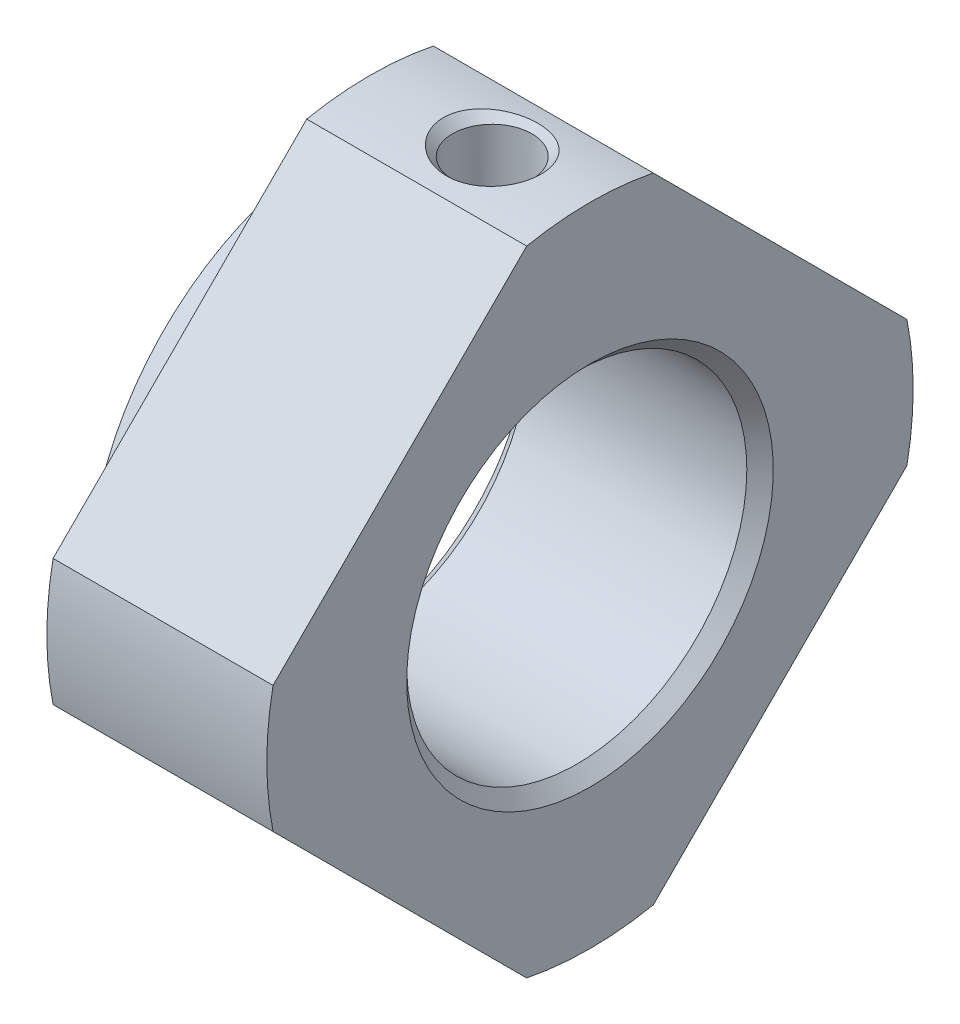
ISO-10303-21;
HEADER;
FILE_DESCRIPTION(('STEP AP214'),'2;1');
FILE_NAME('part.step','',(''),(''),'','','');
FILE_SCHEMA(('AUTOMOTIVE_DESIGN { 1 0 10303 214 1 1 1 1 }'));
ENDSEC;
DATA;
#1=APPLICATION_CONTEXT('core data for automotive mechanical design processes');
#2=APPLICATION_PROTOCOL_DEFINITION('international standard','automotive_design',2000,#1);
#3=PRODUCT_CONTEXT('',#1,'mechanical');
#4=PRODUCT('Part','Part','',(#3));
#5=PRODUCT_RELATED_PRODUCT_CATEGORY('part','',(#4));
#6=PRODUCT_DEFINITION_FORMATION('','',#4);
#7=PRODUCT_DEFINITION_CONTEXT('part definition',#1,'design');
#8=PRODUCT_DEFINITION('design','',#6,#7);
#9=PRODUCT_DEFINITION_SHAPE('','',#8);
#10=(LENGTH_UNIT() NAMED_UNIT(*) SI_UNIT(.MILLI.,.METRE.));
#11=(NAMED_UNIT(*) PLANE_ANGLE_UNIT() SI_UNIT($,.RADIAN.));
#12=(NAMED_UNIT(*) SI_UNIT($,.STERADIAN.) SOLID_ANGLE_UNIT());
#13=UNCERTAINTY_MEASURE_WITH_UNIT(LENGTH_MEASURE(1.E-05),#10,'distance_accuracy_value','');
#14=(GEOMETRIC_REPRESENTATION_CONTEXT(3) GLOBAL_UNCERTAINTY_ASSIGNED_CONTEXT((#13)) GLOBAL_UNIT_ASSIGNED_CONTEXT((#10,
#11,#12)) REPRESENTATION_CONTEXT('',''));
#15=CARTESIAN_POINT('',(0.,0.,0.));
#16=DIRECTION('',(0.,0.,1.));
#17=DIRECTION('',(1.,0.,0.));
#18=AXIS2_PLACEMENT_3D('',#15,#16,#17);
#19=CARTESIAN_POINT('',(33.,3.71231060122937,-3.71231060122938));
#20=DIRECTION('',(-1.,0.,0.));
#21=DIRECTION('',(0.,0.,1.));
#22=AXIS2_PLACEMENT_3D('',#19,#20,#21);
#23=PLANE('',#22);
#24=CARTESIAN_POINT('',(33.,0.,0.));
#25=DIRECTION('',(1.,0.,0.));
#26=DIRECTION('',(0.,0.,-1.));
#27=AXIS2_PLACEMENT_3D('',#24,#25,#26);
#28=CIRCLE('',#27,10.5);
#29=CARTESIAN_POINT('',(33.,0.,-10.5));
#30=VERTEX_POINT('',#29);
#31=EDGE_CURVE('E128',#30,#30,#28,.T.);
#32=ORIENTED_EDGE('',*,*,#31,.F.);
#33=EDGE_LOOP('',(#32));
#34=FACE_BOUND('',#33,.T.);
#35=CARTESIAN_POINT('',(33.,0.,0.));
#36=DIRECTION('',(-1.,0.,0.));
#37=DIRECTION('',(0.,0.,1.));
#38=AXIS2_PLACEMENT_3D('',#35,#36,#37);
#39=CIRCLE('',#38,7.5);
#40=CARTESIAN_POINT('',(33.,0.,7.5));
#41=VERTEX_POINT('',#40);
#42=EDGE_CURVE('E19',#41,#41,#39,.F.);
#43=ORIENTED_EDGE('',*,*,#42,.T.);
#44=EDGE_LOOP('',(#43));
#45=FACE_BOUND('',#44,.T.);
#46=ADVANCED_FACE('F16',(#34,#45),#23,.T.);
#47=CARTESIAN_POINT('',(33.,0.,0.));
#48=DIRECTION('',(-1.,0.,0.));
#49=DIRECTION('',(0.,0.,1.));
#50=AXIS2_PLACEMENT_3D('',#47,#48,#49);
#51=CONICAL_SURFACE('',#50,7.5,0.785398163397448);
#52=CARTESIAN_POINT('',(33.5415,0.,0.));
#53=DIRECTION('',(1.,0.,0.));
#54=DIRECTION('',(0.,0.,-1.));
#55=AXIS2_PLACEMENT_3D('',#52,#53,#54);
#56=CIRCLE('',#55,6.9585);
#57=CARTESIAN_POINT('',(33.5415,0.,-6.9585));
#58=VERTEX_POINT('',#57);
#59=EDGE_CURVE('E126',#58,#58,#56,.T.);
#60=ORIENTED_EDGE('',*,*,#59,.T.);
#61=EDGE_LOOP('',(#60));
#62=FACE_BOUND('',#61,.T.);
#63=ORIENTED_EDGE('',*,*,#42,.F.);
#64=EDGE_LOOP('',(#63));
#65=FACE_BOUND('',#64,.T.);
#66=ADVANCED_FACE('F218',(#62,#65),#51,.F.);
#67=CARTESIAN_POINT('',(39.,6.42194840409422,0.));
#68=DIRECTION('',(0.,-1.,0.));
#69=DIRECTION('',(0.,0.,-1.));
#70=AXIS2_PLACEMENT_3D('',#67,#68,#69);
#71=CYLINDRICAL_SURFACE('',#70,1.621);
#72=CARTESIAN_POINT('',(40.621,6.9585,0.));
#73=CARTESIAN_POINT('',(40.6209961033469,6.95849780594156,0.0897274262725483));
#74=CARTESIAN_POINT('',(40.6135227117356,6.95674642617646,0.179507354052342));
#75=CARTESIAN_POINT('',(40.5838559431143,6.9499266223995,0.356527871141645));
#76=CARTESIAN_POINT('',(40.561648005776,6.94485491738691,0.443765859461116));
#77=CARTESIAN_POINT('',(40.5032539210325,6.9319584347365,0.613088054593298));
#78=CARTESIAN_POINT('',(40.4670852275425,6.92413709581094,0.695178548489428));
#79=CARTESIAN_POINT('',(40.381850776793,6.9065809389101,0.852118334084797));
#80=CARTESIAN_POINT('',(40.3327859235892,6.89684625507751,0.926968132873286));
#81=CARTESIAN_POINT('',(40.2222121858088,6.8763283901825,1.06866478286299));
#82=CARTESIAN_POINT('',(40.1605142906382,6.8655307583926,1.13536206031686));
#83=CARTESIAN_POINT('',(40.026830489751,6.84420308998696,1.25756226192315));
#84=CARTESIAN_POINT('',(39.9548434404866,6.83367308326878,1.31306394012881));
#85=CARTESIAN_POINT('',(39.8014974646031,6.81392955346188,1.41197402254987));
#86=CARTESIAN_POINT('',(39.7200311847712,6.80473443574684,1.45521999563199));
#87=CARTESIAN_POINT('',(39.5507374254725,6.78891032458931,1.52734788122463));
#88=CARTESIAN_POINT('',(39.462910833463,6.78228097395995,1.55623179327318));
#89=CARTESIAN_POINT('',(39.285019027532,6.77248650598185,1.59831532900658));
#90=CARTESIAN_POINT('',(39.1950200921909,6.76926266966684,1.61178115006425));
#91=CARTESIAN_POINT('',(39.0139871226963,6.76646815850686,1.62347463345183));
#92=CARTESIAN_POINT('',(38.922953233911,6.76689697679374,1.62170441004248));
#93=CARTESIAN_POINT('',(38.7444404395851,6.77130632924541,1.60318946410242));
#94=CARTESIAN_POINT('',(38.6569269832336,6.77521268165786,1.58675748517433));
#95=CARTESIAN_POINT('',(38.4859336242832,6.78601930332385,1.53988225455685));
#96=CARTESIAN_POINT('',(38.4024540018105,6.79291978017075,1.50943803133952));
#97=CARTESIAN_POINT('',(38.2410349378862,6.80900826661425,1.43512346233004));
#98=CARTESIAN_POINT('',(38.163151734714,6.81821618664878,1.39113545232069));
#99=CARTESIAN_POINT('',(38.0157633684327,6.83786946067854,1.29106770903717));
#100=CARTESIAN_POINT('',(37.9462589125058,6.84831491897705,1.23498695622492));
#101=CARTESIAN_POINT('',(37.8158093354942,6.86958071935372,1.11069635122768));
#102=CARTESIAN_POINT('',(37.7551151097438,6.88040398222722,1.0422234131));
#103=CARTESIAN_POINT('',(37.6460017062912,6.90097906869489,0.895912339506155));
#104=CARTESIAN_POINT('',(37.5975878406771,6.91073042758797,0.818070172608211));
#105=CARTESIAN_POINT('',(37.514336242374,6.92810288468193,0.654879800905384));
#106=CARTESIAN_POINT('',(37.4795456523797,6.93571656026308,0.569506762699594));
#107=CARTESIAN_POINT('',(37.4249429776949,6.94788944458202,0.394014624097667));
#108=CARTESIAN_POINT('',(37.4050995961583,6.95245503318885,0.303905865348113));
#109=CARTESIAN_POINT('',(37.3883598020422,6.95632462931962,0.177562517043549));
#110=CARTESIAN_POINT('',(37.3848531264986,6.95713845201414,0.142150866952607));
#111=CARTESIAN_POINT('',(37.3801723317949,6.95822662711759,0.0711651298945416));
#112=CARTESIAN_POINT('',(37.3789982193353,6.95850097797686,0.0355910424611007));
#113=CARTESIAN_POINT('',(37.3790044854889,6.95849753647927,-0.089653727089235));
#114=CARTESIAN_POINT('',(37.3864704192277,6.95674801634259,-0.179415039688452));
#115=CARTESIAN_POINT('',(37.4161232412874,6.94993139801827,-0.356455077564178));
#116=CARTESIAN_POINT('',(37.4383383745779,6.94485793466903,-0.443728703787575));
#117=CARTESIAN_POINT('',(37.4967496607638,6.93195763435398,-0.613096107765031));
#118=CARTESIAN_POINT('',(37.5329235413601,6.9241351853814,-0.695197896067546));
#119=CARTESIAN_POINT('',(37.6181611758861,6.90657858086986,-0.852137138773338));
#120=CARTESIAN_POINT('',(37.6672209007002,6.89684502313169,-0.92697685386537));
#121=CARTESIAN_POINT('',(37.7777809267791,6.8763296332837,-1.06865598137256));
#122=CARTESIAN_POINT('',(37.8394701933452,6.86553335313026,-1.13534585655861));
#123=CARTESIAN_POINT('',(37.973152755563,6.8442056440334,-1.25754896710614));
#124=CARTESIAN_POINT('',(38.0451496689862,6.83367430961273,-1.3130582617808));
#125=CARTESIAN_POINT('',(38.1985399144183,6.81392439723727,-1.41199938251277));
#126=CARTESIAN_POINT('',(38.2800439179007,6.80472480966848,-1.45526358708207));
#127=CARTESIAN_POINT('',(38.4493622480002,6.78890361037873,-1.52737875573525));
#128=CARTESIAN_POINT('',(38.53716909795,6.78227900209067,-1.55624648449809));
#129=CARTESIAN_POINT('',(38.6878550936689,6.77397836438543,-1.59190108149123));
#130=CARTESIAN_POINT('',(38.7497437569557,6.77139770047164,-1.60279497058478));
#131=CARTESIAN_POINT('',(38.8744130367346,6.76793696289701,-1.61734569160545));
#132=CARTESIAN_POINT('',(38.9371936252452,6.76705683600506,-1.62100275006376));
#133=CARTESIAN_POINT('',(39.0896901983103,6.76706096731647,-1.62099607279095));
#134=CARTESIAN_POINT('',(39.1794329826773,6.76886171555005,-1.61352867405773));
#135=CARTESIAN_POINT('',(39.3563763131611,6.77585742352259,-1.58388784936477));
#136=CARTESIAN_POINT('',(39.4435742274314,6.78105577550452,-1.5616997255722));
#137=CARTESIAN_POINT('',(39.6128127220595,6.79422611425536,-1.50336318249269));
#138=CARTESIAN_POINT('',(39.6948598561299,6.80219448846792,-1.46723293925978));
#139=CARTESIAN_POINT('',(39.8517242395329,6.82000237430665,-1.38209007411957));
#140=CARTESIAN_POINT('',(39.9265421501401,6.82984171454621,-1.33307863201532));
#141=CARTESIAN_POINT('',(40.0682625353162,6.85049340752902,-1.22256621643576));
#142=CARTESIAN_POINT('',(40.1350071533064,6.86131955960115,-1.16086535850212));
#143=CARTESIAN_POINT('',(40.2573139005216,6.88260728170114,-1.02713920633628));
#144=CARTESIAN_POINT('',(40.3128727259777,6.89306874326404,-0.955110872565959));
#145=CARTESIAN_POINT('',(40.4118681239019,6.91260172880341,-0.801690938500118));
#146=CARTESIAN_POINT('',(40.4551455716705,6.92165437649484,-0.720194159502418));
#147=CARTESIAN_POINT('',(40.5272875294573,6.93717790621283,-0.550890744330228));
#148=CARTESIAN_POINT('',(40.5561685327117,6.94365174093078,-0.463091461191897));
#149=CARTESIAN_POINT('',(40.5918587618999,6.95175570048768,-0.312370610805388));
#150=CARTESIAN_POINT('',(40.6027686222626,6.95427192984923,-0.250436510484477));
#151=CARTESIAN_POINT('',(40.6173404979056,6.95764482327717,-0.125676842415127));
#152=CARTESIAN_POINT('',(40.6210027294856,6.95850153687043,-0.0628513013273721));
#153=CARTESIAN_POINT('',(40.621,6.9585,0.));
#154=B_SPLINE_CURVE_WITH_KNOTS('',3,(#72,#73,#74,#75,#76,#77,#78,#79,#80,#81,#82,#83,#84,#85,
#86,#87,#88,#89,#90,#91,#92,#93,#94,#95,#96,#97,#98,#99,#100,#101,#102,#103,#104,#105,#106,#107,
#108,#109,#110,#111,#112,#113,#114,#115,#116,#117,#118,#119,#120,#121,#122,#123,#124,#125,#126,
#127,#128,#129,#130,#131,#132,#133,#134,#135,#136,#137,#138,#139,#140,#141,#142,#143,#144,#145,
#146,#147,#148,#149,#150,#151,#152,#153),.UNSPECIFIED.,.T.,.F.,(4,2,2,2,2,2,2,2,2,2,2,2,2,2,2,2,
2,2,2,2,2,2,2,2,2,2,2,2,2,2,2,2,2,2,2,2,2,2,2,2,4),(0.,0.268949921474923,0.538166009498942,
0.807046604646519,1.07590835556481,1.3491329467974,1.62238792815899,1.89911111655872,
2.17579576776159,2.44762772592939,2.71942196338999,2.98555370269459,3.25170389681411,
3.5202348764281,3.78878850472314,4.06390983359334,4.33914996891293,4.61533431591922,
4.89093876123474,4.99765746439438,5.10437647410946,5.37320133313643,5.6425424870098,
5.91145565074357,6.18028483122716,6.45347655693769,6.72676440345282,7.00362991127378,
7.28017225227413,7.46843441515294,7.6566906848544,7.92552871648115,8.19463557283574,
8.46339277894898,8.73212537786977,9.0054693357807,9.27889390887561,9.55571433442739,
9.8322168885293,10.020613655975,10.2090048007878),.UNSPECIFIED.);
#155=CARTESIAN_POINT('',(40.621,6.9585,0.));
#156=VERTEX_POINT('',#155);
#157=EDGE_CURVE('E125',#156,#156,#154,.T.);
#158=ORIENTED_EDGE('',*,*,#157,.T.);
#159=EDGE_LOOP('',(#158));
#160=FACE_BOUND('',#159,.T.);
#161=CARTESIAN_POINT('',(39.,12.8438968081355,0.));
#162=DIRECTION('',(0.,1.,0.));
#163=DIRECTION('',(1.,0.,0.));
#164=AXIS2_PLACEMENT_3D('',#161,#162,#163);
#165=CIRCLE('',#164,1.62099999998736);
#166=CARTESIAN_POINT('',(40.6209999999874,12.8438968081355,0.));
#167=VERTEX_POINT('',#166);
#168=EDGE_CURVE('E122',#167,#167,#165,.T.);
#169=ORIENTED_EDGE('',*,*,#168,.T.);
#170=EDGE_LOOP('',(#169));
#171=FACE_BOUND('',#170,.T.);
#172=ADVANCED_FACE('F221',(#160,#171),#71,.F.);
#173=CARTESIAN_POINT('',(33.5,0.,0.));
#174=DIRECTION('',(1.,0.,0.));
#175=DIRECTION('',(0.,0.,-1.));
#176=AXIS2_PLACEMENT_3D('',#173,#174,#175);
#177=CYLINDRICAL_SURFACE('',#176,10.5);
#178=ORIENTED_EDGE('',*,*,#31,.T.);
#179=EDGE_LOOP('',(#178));
#180=FACE_BOUND('',#179,.T.);
#181=CARTESIAN_POINT('',(34.,0.,0.));
#182=DIRECTION('',(1.,0.,0.));
#183=DIRECTION('',(0.,0.,-1.));
#184=AXIS2_PLACEMENT_3D('',#181,#182,#183);
#185=CIRCLE('',#184,10.5);
#186=CARTESIAN_POINT('',(34.,0.,-10.5));
#187=VERTEX_POINT('',#186);
#188=EDGE_CURVE('E121',#187,#187,#185,.T.);
#189=ORIENTED_EDGE('',*,*,#188,.F.);
#190=EDGE_LOOP('',(#189));
#191=FACE_BOUND('',#190,.T.);
#192=ADVANCED_FACE('F212',(#180,#191),#177,.T.);
#193=CARTESIAN_POINT('',(38.,0.,0.));
#194=DIRECTION('',(1.,0.,0.));
#195=DIRECTION('',(0.,0.,-1.));
#196=AXIS2_PLACEMENT_3D('',#193,#194,#195);
#197=CYLINDRICAL_SURFACE('',#196,6.9585);
#198=CARTESIAN_POINT('',(42.4585,0.,0.));
#199=DIRECTION('',(1.,0.,0.));
#200=DIRECTION('',(0.,0.707106781186547,-0.707106781186548));
#201=AXIS2_PLACEMENT_3D('',#198,#199,#200);
#202=CIRCLE('',#201,6.9585);
#203=CARTESIAN_POINT('',(42.4585,4.92040253688659,-4.92040253688659));
#204=VERTEX_POINT('',#203);
#205=EDGE_CURVE('E115',#204,#204,#202,.T.);
#206=ORIENTED_EDGE('',*,*,#205,.T.);
#207=EDGE_LOOP('',(#206));
#208=FACE_BOUND('',#207,.T.);
#209=ORIENTED_EDGE('',*,*,#157,.F.);
#210=EDGE_LOOP('',(#209));
#211=FACE_BOUND('',#210,.T.);
#212=ORIENTED_EDGE('',*,*,#59,.F.);
#213=EDGE_LOOP('',(#212));
#214=FACE_BOUND('',#213,.T.);
#215=ADVANCED_FACE('F192',(#208,#211,#214),#197,.F.);
#216=CARTESIAN_POINT('',(39.,13.2251708080844,0.));
#217=DIRECTION('',(0.,1.,0.));
#218=DIRECTION('',(0.,0.,1.));
#219=AXIS2_PLACEMENT_3D('',#216,#217,#218);
#220=CONICAL_SURFACE('',#219,2.00227399993628,0.785398163397448);
#221=ORIENTED_EDGE('',*,*,#168,.F.);
#222=EDGE_LOOP('',(#221));
#223=FACE_BOUND('',#222,.T.);
#224=CARTESIAN_POINT('',(41.0000000000421,13.2228968081841,0.));
#225=CARTESIAN_POINT('',(40.9999944979641,13.2228953067222,0.0994076211393483));
#226=CARTESIAN_POINT('',(40.9914204731194,13.2217624349911,0.198953904136509));
#227=CARTESIAN_POINT('',(40.9574531970527,13.2173556154039,0.395215174226314));
#228=CARTESIAN_POINT('',(40.9320241947212,13.2140771166432,0.491923685804699));
#229=CARTESIAN_POINT('',(40.866069661638,13.2058373363333,0.677744534794727));
#230=CARTESIAN_POINT('',(40.8258609389972,13.200911551624,0.766971192242707));
#231=CARTESIAN_POINT('',(40.7317959735153,13.1898805813397,0.937754764185677));
#232=CARTESIAN_POINT('',(40.6779442440972,13.1837757859672,1.01931420296382));
#233=CARTESIAN_POINT('',(40.5553219429714,13.1706638550797,1.17693870717324));
#234=CARTESIAN_POINT('',(40.4859399882995,13.163626862398,1.25252505485758));
#235=CARTESIAN_POINT('',(40.3361734995824,13.149622808035,1.39188259121399));
#236=CARTESIAN_POINT('',(40.2557846305592,13.1426557750729,1.45564910133872));
#237=CARTESIAN_POINT('',(40.0803446818256,13.1290058181026,1.57417174127924));
#238=CARTESIAN_POINT('',(39.9846649063983,13.1223755752093,1.62800388458798));
#239=CARTESIAN_POINT('',(39.7859129140129,13.1106531491969,1.71986169658615));
#240=CARTESIAN_POINT('',(39.6828388168258,13.1055613590036,1.75788332815296));
#241=CARTESIAN_POINT('',(39.4662295013136,13.0972136512615,1.81906867703983));
#242=CARTESIAN_POINT('',(39.3524300843414,13.0940721942731,1.84131541412874));
#243=CARTESIAN_POINT('',(39.1226842434343,13.0904239284838,1.86707545106536));
#244=CARTESIAN_POINT('',(39.0067374698938,13.0899175525457,1.87058567308205));
#245=CARTESIAN_POINT('',(38.7729705686367,13.0916171497264,1.85865564509565));
#246=CARTESIAN_POINT('',(38.6551744362337,13.0938900912111,1.84274752139968));
#247=CARTESIAN_POINT('',(38.4239513796497,13.101000300555,1.79149481631472));
#248=CARTESIAN_POINT('',(38.3105248068072,13.1058377741582,1.75614867546943));
#249=CARTESIAN_POINT('',(38.091769111381,13.1174896798778,1.66687591107698));
#250=CARTESIAN_POINT('',(37.986414108574,13.1242974275839,1.61301199728289));
#251=CARTESIAN_POINT('',(37.7867299951744,13.1390791213857,1.48780277744489));
#252=CARTESIAN_POINT('',(37.6923988487313,13.1470528515372,1.41646070677036));
#253=CARTESIAN_POINT('',(37.5211307415246,13.1628844905179,1.26070302324883));
#254=CARTESIAN_POINT('',(37.443704134957,13.1707368313336,1.17682638450361));
#255=CARTESIAN_POINT('',(37.3051916540708,13.1856138631103,0.996368974950507));
#256=CARTESIAN_POINT('',(37.2441060660714,13.1926385395683,0.899787981587436));
#257=CARTESIAN_POINT('',(37.1444015293343,13.2045134777083,0.703461462809666));
#258=CARTESIAN_POINT('',(37.1045761580863,13.2094757596757,0.604334221287042));
#259=CARTESIAN_POINT('',(37.0434562414431,13.2172171039965,0.400605910452942));
#260=CARTESIAN_POINT('',(37.0221112606955,13.2200021063936,0.2960205704563));
#261=CARTESIAN_POINT('',(37.0069846080028,13.2219805979434,0.158885636274277));
#262=CARTESIAN_POINT('',(37.0043680527054,13.2223234431989,0.127170397991605));
#263=CARTESIAN_POINT('',(37.0008748549305,13.2227817903769,0.0636415122882178));
#264=CARTESIAN_POINT('',(36.9999982383298,13.2228972889182,0.0318278634109643));
#265=CARTESIAN_POINT('',(37.0000055020393,13.2228953067304,-0.0994076211394996));
#266=CARTESIAN_POINT('',(37.0085795268815,13.2217624349933,-0.198953904136617));
#267=CARTESIAN_POINT('',(37.0425468029464,13.2173556154017,-0.395215174226172));
#268=CARTESIAN_POINT('',(37.0679758052784,13.2140771166426,-0.491923685804355));
#269=CARTESIAN_POINT('',(37.133930338362,13.2058373363339,-0.677744534794172));
#270=CARTESIAN_POINT('',(37.1741390610026,13.2009115516242,-0.766971192242136));
#271=CARTESIAN_POINT('',(37.2682040264843,13.1898805813396,-0.93775476418515));
#272=CARTESIAN_POINT('',(37.3220557559025,13.1837757859671,-1.01931420296335));
#273=CARTESIAN_POINT('',(37.4446780570283,13.1706638550797,-1.17693870717285));
#274=CARTESIAN_POINT('',(37.5140600117001,13.163626862398,-1.25252505485722));
#275=CARTESIAN_POINT('',(37.6638265004172,13.1496228080351,-1.39188259121366));
#276=CARTESIAN_POINT('',(37.7442153694404,13.142655775073,-1.4556491013384));
#277=CARTESIAN_POINT('',(37.9196553181739,13.1290058181027,-1.57417174127894));
#278=CARTESIAN_POINT('',(38.0153350936012,13.1223755752093,-1.6280038845877));
#279=CARTESIAN_POINT('',(38.2140870859866,13.110653149197,-1.71986169658593));
#280=CARTESIAN_POINT('',(38.3171611831736,13.1055613590036,-1.75788332815277));
#281=CARTESIAN_POINT('',(38.5337704986858,13.0972136512615,-1.8190686770397));
#282=CARTESIAN_POINT('',(38.6475699156579,13.0940721942732,-1.84131541412864));
#283=CARTESIAN_POINT('',(38.8773157565651,13.0904239284838,-1.86707545106533));
#284=CARTESIAN_POINT('',(38.9932625301055,13.0899175525457,-1.87058567308205));
#285=CARTESIAN_POINT('',(39.2270294313627,13.0916171497264,-1.85865564509572));
#286=CARTESIAN_POINT('',(39.3448255637656,13.0938900912111,-1.84274752139978));
#287=CARTESIAN_POINT('',(39.5760486203497,13.101000300555,-1.7914948163149));
#288=CARTESIAN_POINT('',(39.6894751931922,13.1058377741581,-1.75614867546964));
#289=CARTESIAN_POINT('',(39.9082308886184,13.1174896798778,-1.66687591107726));
#290=CARTESIAN_POINT('',(40.0135858914254,13.1242974275838,-1.61301199728321));
#291=CARTESIAN_POINT('',(40.2132700048251,13.1390791213856,-1.48780277744528));
#292=CARTESIAN_POINT('',(40.3076011512682,13.1470528515372,-1.41646070677077));
#293=CARTESIAN_POINT('',(40.478869258475,13.1628844905179,-1.26070302324926));
#294=CARTESIAN_POINT('',(40.5562958650426,13.1707368313336,-1.17682638450402));
#295=CARTESIAN_POINT('',(40.6948083459289,13.1856138631103,-0.996368974950953));
#296=CARTESIAN_POINT('',(40.7558939339283,13.1926385395682,-0.899787981587928));
#297=CARTESIAN_POINT('',(40.8555984706654,13.2045134777084,-0.703461462810253));
#298=CARTESIAN_POINT('',(40.8954238419134,13.209475759676,-0.604334221287681));
#299=CARTESIAN_POINT('',(40.9565437585569,13.2172171039962,-0.400605910453594));
#300=CARTESIAN_POINT('',(40.9778887393049,13.2200021063924,-0.296020570456909));
#301=CARTESIAN_POINT('',(40.9930153919971,13.2219805979438,-0.158885636274753));
#302=CARTESIAN_POINT('',(40.9956319472942,13.2223234431998,-0.127170397992006));
#303=CARTESIAN_POINT('',(40.9991251450698,13.222781790376,-0.0636415122885003));
#304=CARTESIAN_POINT('',(41.0000017616715,13.222897288915,-0.0318278634112027));
#305=CARTESIAN_POINT('',(41.0000000000421,13.2228968081841,0.));
#306=B_SPLINE_CURVE_WITH_KNOTS('',3,(#224,#225,#226,#227,#228,#229,#230,#231,#232,#233,#234,
#235,#236,#237,#238,#239,#240,#241,#242,#243,#244,#245,#246,#247,#248,#249,#250,#251,#252,#253,
#254,#255,#256,#257,#258,#259,#260,#261,#262,#263,#264,#265,#266,#267,#268,#269,#270,#271,#272,
#273,#274,#275,#276,#277,#278,#279,#280,#281,#282,#283,#284,#285,#286,#287,#288,#289,#290,#291,
#292,#293,#294,#295,#296,#297,#298,#299,#300,#301,#302,#303,#304,#305),.UNSPECIFIED.,.T.,.F.,(4,
2,2,2,2,2,2,2,2,2,2,2,2,2,2,2,2,2,2,2,2,2,2,2,2,2,2,2,2,2,2,2,2,2,2,2,2,2,2,2,4),(0.,
0.298095526417449,0.596825375642354,0.889493425134025,1.18206477939252,1.48926685494375,
1.7965902692654,2.12509617978609,2.45368592095634,2.80008500818384,3.14654099633714,
3.50151197220544,3.85651143053143,4.21032034906822,4.56406382370339,4.90554378568949,
5.24702973052672,5.56622075780958,5.88453790092528,5.97997930158107,6.07542212165407,
6.37351764807126,6.67224749729557,6.96491554678712,7.25748690104576,7.56468897659703,
7.87201239091861,8.20051830143924,8.52910804260951,8.87550712983701,9.22196311799028,
9.57693409385858,9.93193355218456,10.2857424707213,10.6394859453565,10.9809659073428,
11.3224518521799,11.6416428794626,11.9599600225785,12.0554014232345,12.1508442433077),.UNSPECIFIED.);
#307=CARTESIAN_POINT('',(41.0000000000421,13.2228968081841,0.));
#308=VERTEX_POINT('',#307);
#309=EDGE_CURVE('E149',#308,#308,#306,.T.);
#310=ORIENTED_EDGE('',*,*,#309,.F.);
#311=EDGE_LOOP('',(#310));
#312=FACE_BOUND('',#311,.T.);
#313=ADVANCED_FACE('F156',(#223,#312),#220,.F.);
#314=CARTESIAN_POINT('',(34.,8.38731060122937,-8.38731060122938));
#315=DIRECTION('',(-1.,0.,0.));
#316=DIRECTION('',(0.,0.,1.));
#317=AXIS2_PLACEMENT_3D('',#314,#315,#316);
#318=PLANE('',#317);
#319=ORIENTED_EDGE('',*,*,#188,.T.);
#320=EDGE_LOOP('',(#319));
#321=FACE_BOUND('',#320,.T.);
#322=DIRECTION('',(0.,-0.707106781186548,0.707106781186547));
#323=VECTOR('',#322,1.);
#324=CARTESIAN_POINT('',(34.,-15.556349186104,0.));
#325=LINE('',#324,#323);
#326=CARTESIAN_POINT('',(34.,-2.58948497042087,-12.9668642156831));
#327=VERTEX_POINT('',#326);
#328=CARTESIAN_POINT('',(34.,-12.9668642156831,-2.58948497042086));
#329=VERTEX_POINT('',#328);
#330=EDGE_CURVE('E82',#327,#329,#325,.T.);
#331=ORIENTED_EDGE('',*,*,#330,.T.);
#332=CARTESIAN_POINT('',(34.,0.,0.));
#333=DIRECTION('',(1.,0.,0.));
#334=DIRECTION('',(0.,0.,-1.));
#335=AXIS2_PLACEMENT_3D('',#332,#333,#334);
#336=CIRCLE('',#335,13.2228968081884);
#337=CARTESIAN_POINT('',(34.,-12.9668642156831,2.58948497042087));
#338=VERTEX_POINT('',#337);
#339=EDGE_CURVE('E85',#338,#329,#336,.T.);
#340=ORIENTED_EDGE('',*,*,#339,.F.);
#341=DIRECTION('',(0.,0.707106781186547,0.707106781186548));
#342=VECTOR('',#341,1.);
#343=CARTESIAN_POINT('',(34.,0.,15.556349186104));
#344=LINE('',#343,#342);
#345=CARTESIAN_POINT('',(34.,-2.58948497042088,12.9668642156831));
#346=VERTEX_POINT('',#345);
#347=EDGE_CURVE('E77',#338,#346,#344,.T.);
#348=ORIENTED_EDGE('',*,*,#347,.T.);
#349=CARTESIAN_POINT('',(34.,0.,0.));
#350=DIRECTION('',(1.,0.,0.));
#351=DIRECTION('',(0.,0.,-1.));
#352=AXIS2_PLACEMENT_3D('',#349,#350,#351);
#353=CIRCLE('',#352,13.2228968081884);
#354=CARTESIAN_POINT('',(34.,2.58948497042087,12.9668642156831));
#355=VERTEX_POINT('',#354);
#356=EDGE_CURVE('E143',#355,#346,#353,.T.);
#357=ORIENTED_EDGE('',*,*,#356,.F.);
#358=DIRECTION('',(0.,0.707106781186548,-0.707106781186547));
#359=VECTOR('',#358,1.);
#360=CARTESIAN_POINT('',(34.,15.556349186104,0.));
#361=LINE('',#360,#359);
#362=CARTESIAN_POINT('',(34.,12.9668642156831,2.58948497042086));
#363=VERTEX_POINT('',#362);
#364=EDGE_CURVE('E110',#355,#363,#361,.T.);
#365=ORIENTED_EDGE('',*,*,#364,.T.);
#366=CARTESIAN_POINT('',(34.,0.,0.));
#367=DIRECTION('',(1.,0.,0.));
#368=DIRECTION('',(0.,0.,-1.));
#369=AXIS2_PLACEMENT_3D('',#366,#367,#368);
#370=CIRCLE('',#369,13.2228968081884);
#371=CARTESIAN_POINT('',(34.,12.9668642156831,-2.58948497042087));
#372=VERTEX_POINT('',#371);
#373=EDGE_CURVE('E113',#372,#363,#370,.T.);
#374=ORIENTED_EDGE('',*,*,#373,.F.);
#375=DIRECTION('',(0.,-0.707106781186547,-0.707106781186548));
#376=VECTOR('',#375,1.);
#377=CARTESIAN_POINT('',(34.,0.,-15.556349186104));
#378=LINE('',#377,#376);
#379=CARTESIAN_POINT('',(34.,2.58948497042086,-12.9668642156831));
#380=VERTEX_POINT('',#379);
#381=EDGE_CURVE('E116',#372,#380,#378,.T.);
#382=ORIENTED_EDGE('',*,*,#381,.T.);
#383=CARTESIAN_POINT('',(34.,0.,0.));
#384=DIRECTION('',(1.,0.,0.));
#385=DIRECTION('',(0.,0.,-1.));
#386=AXIS2_PLACEMENT_3D('',#383,#384,#385);
#387=CIRCLE('',#386,13.2228968081884);
#388=EDGE_CURVE('E88',#327,#380,#387,.T.);
#389=ORIENTED_EDGE('',*,*,#388,.F.);
#390=EDGE_LOOP('',(#331,#340,#348,#357,#365,#374,#382,#389));
#391=FACE_BOUND('',#390,.T.);
#392=ADVANCED_FACE('F84',(#321,#391),#318,.T.);
#393=CARTESIAN_POINT('',(43.,0.,0.));
#394=DIRECTION('',(1.,0.,0.));
#395=DIRECTION('',(0.,1.,0.));
#396=AXIS2_PLACEMENT_3D('',#393,#394,#395);
#397=CONICAL_SURFACE('',#396,7.5,0.785398163397449);
#398=CARTESIAN_POINT('',(43.,0.,0.));
#399=DIRECTION('',(1.,0.,0.));
#400=DIRECTION('',(0.,1.,0.));
#401=AXIS2_PLACEMENT_3D('',#398,#399,#400);
#402=CIRCLE('',#401,7.5);
#403=CARTESIAN_POINT('',(43.,7.5,0.));
#404=VERTEX_POINT('',#403);
#405=EDGE_CURVE('E140',#404,#404,#402,.F.);
#406=ORIENTED_EDGE('',*,*,#405,.F.);
#407=EDGE_LOOP('',(#406));
#408=FACE_BOUND('',#407,.T.);
#409=ORIENTED_EDGE('',*,*,#205,.F.);
#410=EDGE_LOOP('',(#409));
#411=FACE_BOUND('',#410,.T.);
#412=ADVANCED_FACE('F183',(#408,#411),#397,.F.);
#413=CARTESIAN_POINT('',(33.,0.,15.556349186104));
#414=DIRECTION('',(0.,0.707106781186548,-0.707106781186547));
#415=DIRECTION('',(0.,0.707106781186547,0.707106781186548));
#416=AXIS2_PLACEMENT_3D('',#413,#414,#415);
#417=PLANE('',#416);
#418=DIRECTION('',(1.,0.,0.));
#419=VECTOR('',#418,1.);
#420=CARTESIAN_POINT('',(38.5,-2.58948497042087,12.9668642156831));
#421=LINE('',#420,#419);
#422=CARTESIAN_POINT('',(43.,-2.58948497042093,12.9668642156831));
#423=VERTEX_POINT('',#422);
#424=EDGE_CURVE('E393',#346,#423,#421,.T.);
#425=ORIENTED_EDGE('',*,*,#424,.F.);
#426=ORIENTED_EDGE('',*,*,#347,.F.);
#427=DIRECTION('',(1.,0.,0.));
#428=VECTOR('',#427,1.);
#429=CARTESIAN_POINT('',(38.5,-12.9668642156831,2.58948497042087));
#430=LINE('',#429,#428);
#431=CARTESIAN_POINT('',(43.,-12.9668642156831,2.58948497042093));
#432=VERTEX_POINT('',#431);
#433=EDGE_CURVE('E98',#432,#338,#430,.F.);
#434=ORIENTED_EDGE('',*,*,#433,.F.);
#435=DIRECTION('',(0.,-0.707106781186547,-0.707106781186547));
#436=VECTOR('',#435,1.);
#437=CARTESIAN_POINT('',(43.,-2.58948497042089,12.9668642156832));
#438=LINE('',#437,#436);
#439=EDGE_CURVE('E139',#423,#432,#438,.T.);
#440=ORIENTED_EDGE('',*,*,#439,.F.);
#441=EDGE_LOOP('',(#425,#426,#434,#440));
#442=FACE_BOUND('',#441,.T.);
#443=ADVANCED_FACE('F180',(#442),#417,.F.);
#444=CARTESIAN_POINT('',(38.5,0.,0.));
#445=DIRECTION('',(1.,0.,0.));
#446=DIRECTION('',(0.,0.,-1.));
#447=AXIS2_PLACEMENT_3D('',#444,#445,#446);
#448=CYLINDRICAL_SURFACE('',#447,13.2228968081884);
#449=DIRECTION('',(1.,0.,0.));
#450=VECTOR('',#449,1.);
#451=CARTESIAN_POINT('',(33.,-12.9668642156832,-2.58948497042084));
#452=LINE('',#451,#450);
#453=CARTESIAN_POINT('',(43.,-12.9668642156831,-2.58948497042092));
#454=VERTEX_POINT('',#453);
#455=EDGE_CURVE('E92',#329,#454,#452,.T.);
#456=ORIENTED_EDGE('',*,*,#455,.T.);
#457=CARTESIAN_POINT('',(43.,0.,0.));
#458=DIRECTION('',(1.,0.,0.));
#459=DIRECTION('',(0.,0.,-1.));
#460=AXIS2_PLACEMENT_3D('',#457,#458,#459);
#461=CIRCLE('',#460,13.2228968081884);
#462=EDGE_CURVE('E137',#432,#454,#461,.T.);
#463=ORIENTED_EDGE('',*,*,#462,.F.);
#464=ORIENTED_EDGE('',*,*,#433,.T.);
#465=ORIENTED_EDGE('',*,*,#339,.T.);
#466=EDGE_LOOP('',(#456,#463,#464,#465));
#467=FACE_BOUND('',#466,.T.);
#468=ADVANCED_FACE('F95',(#467),#448,.T.);
#469=CARTESIAN_POINT('',(33.,-15.556349186104,0.));
#470=DIRECTION('',(0.,0.707106781186547,0.707106781186548));
#471=DIRECTION('',(0.,-0.707106781186548,0.707106781186547));
#472=AXIS2_PLACEMENT_3D('',#469,#470,#471);
#473=PLANE('',#472);
#474=ORIENTED_EDGE('',*,*,#455,.F.);
#475=ORIENTED_EDGE('',*,*,#330,.F.);
#476=DIRECTION('',(1.,0.,0.));
#477=VECTOR('',#476,1.);
#478=CARTESIAN_POINT('',(38.5,-2.58948497042087,-12.9668642156831));
#479=LINE('',#478,#477);
#480=CARTESIAN_POINT('',(43.,-2.58948497042093,-12.9668642156831));
#481=VERTEX_POINT('',#480);
#482=EDGE_CURVE('E104',#481,#327,#479,.F.);
#483=ORIENTED_EDGE('',*,*,#482,.F.);
#484=DIRECTION('',(0.,0.707106781186547,-0.707106781186547));
#485=VECTOR('',#484,1.);
#486=CARTESIAN_POINT('',(43.,-12.9668642156832,-2.58948497042089));
#487=LINE('',#486,#485);
#488=EDGE_CURVE('E102',#454,#481,#487,.T.);
#489=ORIENTED_EDGE('',*,*,#488,.F.);
#490=EDGE_LOOP('',(#474,#475,#483,#489));
#491=FACE_BOUND('',#490,.T.);
#492=ADVANCED_FACE('F100',(#491),#473,.F.);
#493=CARTESIAN_POINT('',(38.5,0.,0.));
#494=DIRECTION('',(1.,0.,0.));
#495=DIRECTION('',(0.,0.,-1.));
#496=AXIS2_PLACEMENT_3D('',#493,#494,#495);
#497=CYLINDRICAL_SURFACE('',#496,13.2228968081884);
#498=DIRECTION('',(1.,0.,0.));
#499=VECTOR('',#498,1.);
#500=CARTESIAN_POINT('',(33.,2.58948497042084,-12.9668642156832));
#501=LINE('',#500,#499);
#502=CARTESIAN_POINT('',(43.,2.58948497042092,-12.9668642156831));
#503=VERTEX_POINT('',#502);
#504=EDGE_CURVE('E117',#380,#503,#501,.T.);
#505=ORIENTED_EDGE('',*,*,#504,.T.);
#506=CARTESIAN_POINT('',(43.,0.,0.));
#507=DIRECTION('',(1.,0.,0.));
#508=DIRECTION('',(0.,0.,-1.));
#509=AXIS2_PLACEMENT_3D('',#506,#507,#508);
#510=CIRCLE('',#509,13.2228968081884);
#511=EDGE_CURVE('E134',#481,#503,#510,.T.);
#512=ORIENTED_EDGE('',*,*,#511,.F.);
#513=ORIENTED_EDGE('',*,*,#482,.T.);
#514=ORIENTED_EDGE('',*,*,#388,.T.);
#515=EDGE_LOOP('',(#505,#512,#513,#514));
#516=FACE_BOUND('',#515,.T.);
#517=ADVANCED_FACE('F171',(#516),#497,.T.);
#518=CARTESIAN_POINT('',(33.,0.,-15.556349186104));
#519=DIRECTION('',(0.,-0.707106781186548,0.707106781186547));
#520=DIRECTION('',(0.,-0.707106781186547,-0.707106781186548));
#521=AXIS2_PLACEMENT_3D('',#518,#519,#520);
#522=PLANE('',#521);
#523=ORIENTED_EDGE('',*,*,#504,.F.);
#524=ORIENTED_EDGE('',*,*,#381,.F.);
#525=DIRECTION('',(1.,0.,0.));
#526=VECTOR('',#525,1.);
#527=CARTESIAN_POINT('',(38.5,12.9668642156831,-2.58948497042087));
#528=LINE('',#527,#526);
#529=CARTESIAN_POINT('',(43.,12.9668642156831,-2.58948497042093));
#530=VERTEX_POINT('',#529);
#531=EDGE_CURVE('E148',#530,#372,#528,.F.);
#532=ORIENTED_EDGE('',*,*,#531,.F.);
#533=DIRECTION('',(0.,0.707106781186547,0.707106781186547));
#534=VECTOR('',#533,1.);
#535=CARTESIAN_POINT('',(43.,2.58948497042089,-12.9668642156832));
#536=LINE('',#535,#534);
#537=EDGE_CURVE('E133',#503,#530,#536,.T.);
#538=ORIENTED_EDGE('',*,*,#537,.F.);
#539=EDGE_LOOP('',(#523,#524,#532,#538));
#540=FACE_BOUND('',#539,.T.);
#541=ADVANCED_FACE('F166',(#540),#522,.F.);
#542=CARTESIAN_POINT('',(38.5,0.,0.));
#543=DIRECTION('',(1.,0.,0.));
#544=DIRECTION('',(0.,0.,-1.));
#545=AXIS2_PLACEMENT_3D('',#542,#543,#544);
#546=CYLINDRICAL_SURFACE('',#545,13.2228968081884);
#547=DIRECTION('',(1.,0.,0.));
#548=VECTOR('',#547,1.);
#549=CARTESIAN_POINT('',(33.,12.9668642156832,2.58948497042084));
#550=LINE('',#549,#548);
#551=CARTESIAN_POINT('',(43.,12.9668642156831,2.58948497042092));
#552=VERTEX_POINT('',#551);
#553=EDGE_CURVE('E112',#363,#552,#550,.T.);
#554=ORIENTED_EDGE('',*,*,#553,.T.);
#555=CARTESIAN_POINT('',(43.,0.,0.));
#556=DIRECTION('',(1.,0.,0.));
#557=DIRECTION('',(0.,0.,-1.));
#558=AXIS2_PLACEMENT_3D('',#555,#556,#557);
#559=CIRCLE('',#558,13.2228968081884);
#560=EDGE_CURVE('E130',#530,#552,#559,.T.);
#561=ORIENTED_EDGE('',*,*,#560,.F.);
#562=ORIENTED_EDGE('',*,*,#531,.T.);
#563=ORIENTED_EDGE('',*,*,#373,.T.);
#564=EDGE_LOOP('',(#554,#561,#562,#563));
#565=FACE_BOUND('',#564,.T.);
#566=ORIENTED_EDGE('',*,*,#309,.T.);
#567=EDGE_LOOP('',(#566));
#568=FACE_BOUND('',#567,.T.);
#569=ADVANCED_FACE('F160',(#565,#568),#546,.T.);
#570=CARTESIAN_POINT('',(33.,15.556349186104,0.));
#571=DIRECTION('',(0.,-0.707106781186547,-0.707106781186548));
#572=DIRECTION('',(0.,0.707106781186548,-0.707106781186547));
#573=AXIS2_PLACEMENT_3D('',#570,#571,#572);
#574=PLANE('',#573);
#575=ORIENTED_EDGE('',*,*,#553,.F.);
#576=ORIENTED_EDGE('',*,*,#364,.F.);
#577=DIRECTION('',(1.,0.,0.));
#578=VECTOR('',#577,1.);
#579=CARTESIAN_POINT('',(38.5,2.58948497042087,12.9668642156831));
#580=LINE('',#579,#578);
#581=CARTESIAN_POINT('',(43.,2.58948497042093,12.9668642156831));
#582=VERTEX_POINT('',#581);
#583=EDGE_CURVE('E34',#582,#355,#580,.F.);
#584=ORIENTED_EDGE('',*,*,#583,.F.);
#585=DIRECTION('',(0.,-0.707106781186547,0.707106781186547));
#586=VECTOR('',#585,1.);
#587=CARTESIAN_POINT('',(43.,12.9668642156832,2.58948497042089));
#588=LINE('',#587,#586);
#589=EDGE_CURVE('E25',#552,#582,#588,.T.);
#590=ORIENTED_EDGE('',*,*,#589,.F.);
#591=EDGE_LOOP('',(#575,#576,#584,#590));
#592=FACE_BOUND('',#591,.T.);
#593=ADVANCED_FACE('F165',(#592),#574,.F.);
#594=CARTESIAN_POINT('',(38.5,0.,0.));
#595=DIRECTION('',(1.,0.,0.));
#596=DIRECTION('',(0.,0.,-1.));
#597=AXIS2_PLACEMENT_3D('',#594,#595,#596);
#598=CYLINDRICAL_SURFACE('',#597,13.2228968081884);
#599=ORIENTED_EDGE('',*,*,#583,.T.);
#600=ORIENTED_EDGE('',*,*,#356,.T.);
#601=ORIENTED_EDGE('',*,*,#424,.T.);
#602=CARTESIAN_POINT('',(43.,0.,0.));
#603=DIRECTION('',(1.,0.,0.));
#604=DIRECTION('',(0.,0.,-1.));
#605=AXIS2_PLACEMENT_3D('',#602,#603,#604);
#606=CIRCLE('',#605,13.2228968081884);
#607=EDGE_CURVE('E10',#582,#423,#606,.T.);
#608=ORIENTED_EDGE('',*,*,#607,.F.);
#609=EDGE_LOOP('',(#599,#600,#601,#608));
#610=FACE_BOUND('',#609,.T.);
#611=ADVANCED_FACE('F197',(#610),#598,.T.);
#612=CARTESIAN_POINT('',(43.,4.675,-4.675));
#613=DIRECTION('',(1.,0.,0.));
#614=DIRECTION('',(0.,0.,-1.));
#615=AXIS2_PLACEMENT_3D('',#612,#613,#614);
#616=PLANE('',#615);
#617=ORIENTED_EDGE('',*,*,#589,.T.);
#618=ORIENTED_EDGE('',*,*,#607,.T.);
#619=ORIENTED_EDGE('',*,*,#439,.T.);
#620=ORIENTED_EDGE('',*,*,#462,.T.);
#621=ORIENTED_EDGE('',*,*,#488,.T.);
#622=ORIENTED_EDGE('',*,*,#511,.T.);
#623=ORIENTED_EDGE('',*,*,#537,.T.);
#624=ORIENTED_EDGE('',*,*,#560,.T.);
#625=EDGE_LOOP('',(#617,#618,#619,#620,#621,#622,#623,#624));
#626=FACE_BOUND('',#625,.T.);
#627=ORIENTED_EDGE('',*,*,#405,.T.);
#628=EDGE_LOOP('',(#627));
#629=FACE_BOUND('',#628,.T.);
#630=ADVANCED_FACE('F195',(#626,#629),#616,.T.);
#631=CLOSED_SHELL('',(#46,#66,#172,#192,#215,#313,#392,#412,#443,#468,#492,#517,#541,#569,#593,
#611,#630));
#632=MANIFOLD_SOLID_BREP('B1',#631);
#633=ADVANCED_BREP_SHAPE_REPRESENTATION('',(#18,#632),#14);
#634=SHAPE_DEFINITION_REPRESENTATION(#9,#633);
ENDSEC;
END-ISO-10303-21;
